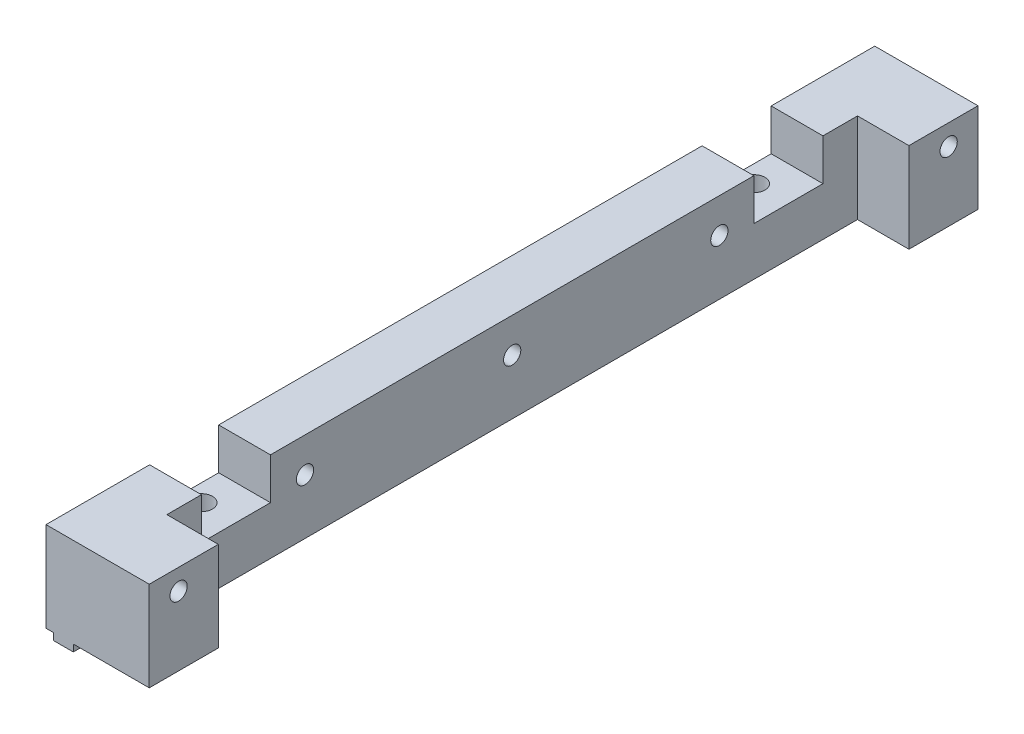
ISO-10303-21;
HEADER;
FILE_DESCRIPTION(('STEP AP214'),'2;1');
FILE_NAME('part.step','',(''),(''),'','','');
FILE_SCHEMA(('AUTOMOTIVE_DESIGN { 1 0 10303 214 1 1 1 1 }'));
ENDSEC;
DATA;
#1=APPLICATION_CONTEXT('core data for automotive mechanical design processes');
#2=APPLICATION_PROTOCOL_DEFINITION('international standard','automotive_design',2000,#1);
#3=PRODUCT_CONTEXT('',#1,'mechanical');
#4=PRODUCT('Part','Part','',(#3));
#5=PRODUCT_RELATED_PRODUCT_CATEGORY('part','',(#4));
#6=PRODUCT_DEFINITION_FORMATION('','',#4);
#7=PRODUCT_DEFINITION_CONTEXT('part definition',#1,'design');
#8=PRODUCT_DEFINITION('design','',#6,#7);
#9=PRODUCT_DEFINITION_SHAPE('','',#8);
#10=(LENGTH_UNIT() NAMED_UNIT(*) SI_UNIT(.MILLI.,.METRE.));
#11=(NAMED_UNIT(*) PLANE_ANGLE_UNIT() SI_UNIT($,.RADIAN.));
#12=(NAMED_UNIT(*) SI_UNIT($,.STERADIAN.) SOLID_ANGLE_UNIT());
#13=UNCERTAINTY_MEASURE_WITH_UNIT(LENGTH_MEASURE(1.E-05),#10,'distance_accuracy_value','');
#14=(GEOMETRIC_REPRESENTATION_CONTEXT(3) GLOBAL_UNCERTAINTY_ASSIGNED_CONTEXT((#13)) GLOBAL_UNIT_ASSIGNED_CONTEXT((#10,
#11,#12)) REPRESENTATION_CONTEXT('',''));
#15=CARTESIAN_POINT('',(0.,0.,0.));
#16=DIRECTION('',(0.,0.,1.));
#17=DIRECTION('',(1.,0.,0.));
#18=AXIS2_PLACEMENT_3D('',#15,#16,#17);
#19=CARTESIAN_POINT('',(0.,13.,60.));
#20=DIRECTION('',(0.,-1.,0.));
#21=DIRECTION('',(0.,0.,-1.));
#22=AXIS2_PLACEMENT_3D('',#19,#20,#21);
#23=PLANE('',#22);
#24=DIRECTION('',(0.,0.,-1.));
#25=VECTOR('',#24,1.);
#26=CARTESIAN_POINT('',(0.,13.,60.));
#27=LINE('',#26,#25);
#28=CARTESIAN_POINT('',(0.,13.,35.));
#29=VERTEX_POINT('',#28);
#30=CARTESIAN_POINT('',(0.,13.,-35.));
#31=VERTEX_POINT('',#30);
#32=EDGE_CURVE('E405',#29,#31,#27,.T.);
#33=ORIENTED_EDGE('',*,*,#32,.F.);
#34=DIRECTION('',(-1.,0.,0.));
#35=VECTOR('',#34,1.);
#36=CARTESIAN_POINT('',(14.95,13.,35.));
#37=LINE('',#36,#35);
#38=CARTESIAN_POINT('',(7.5,13.,35.));
#39=VERTEX_POINT('',#38);
#40=EDGE_CURVE('E232',#39,#29,#37,.T.);
#41=ORIENTED_EDGE('',*,*,#40,.F.);
#42=DIRECTION('',(0.,0.,1.));
#43=VECTOR('',#42,1.);
#44=CARTESIAN_POINT('',(7.5,13.,-50.));
#45=LINE('',#44,#43);
#46=CARTESIAN_POINT('',(7.5,13.,-35.));
#47=VERTEX_POINT('',#46);
#48=EDGE_CURVE('E287',#47,#39,#45,.T.);
#49=ORIENTED_EDGE('',*,*,#48,.F.);
#50=DIRECTION('',(-1.,0.,0.));
#51=VECTOR('',#50,1.);
#52=CARTESIAN_POINT('',(14.95,13.,-35.));
#53=LINE('',#52,#51);
#54=EDGE_CURVE('E256',#47,#31,#53,.T.);
#55=ORIENTED_EDGE('',*,*,#54,.T.);
#56=EDGE_LOOP('',(#33,#41,#49,#55));
#57=FACE_BOUND('',#56,.T.);
#58=ADVANCED_FACE('F33',(#57),#23,.F.);
#59=CARTESIAN_POINT('',(7.5,13.,45.));
#60=VERTEX_POINT('',#59);
#61=CARTESIAN_POINT('',(7.5,13.,50.));
#62=VERTEX_POINT('',#61);
#63=EDGE_CURVE('E281',#60,#62,#45,.T.);
#64=ORIENTED_EDGE('',*,*,#63,.F.);
#65=DIRECTION('',(-1.,0.,0.));
#66=VECTOR('',#65,1.);
#67=CARTESIAN_POINT('',(14.95,13.,45.));
#68=LINE('',#67,#66);
#69=CARTESIAN_POINT('',(0.,13.,45.));
#70=VERTEX_POINT('',#69);
#71=EDGE_CURVE('E242',#60,#70,#68,.T.);
#72=ORIENTED_EDGE('',*,*,#71,.T.);
#73=CARTESIAN_POINT('',(0.,13.,60.));
#74=VERTEX_POINT('',#73);
#75=EDGE_CURVE('E402',#74,#70,#27,.T.);
#76=ORIENTED_EDGE('',*,*,#75,.F.);
#77=DIRECTION('',(-1.,0.,0.));
#78=VECTOR('',#77,1.);
#79=CARTESIAN_POINT('',(0.,13.,60.));
#80=LINE('',#79,#78);
#81=CARTESIAN_POINT('',(14.95,13.,60.));
#82=VERTEX_POINT('',#81);
#83=EDGE_CURVE('E377',#82,#74,#80,.T.);
#84=ORIENTED_EDGE('',*,*,#83,.F.);
#85=DIRECTION('',(0.,0.,-1.));
#86=VECTOR('',#85,1.);
#87=CARTESIAN_POINT('',(14.95,13.,60.));
#88=LINE('',#87,#86);
#89=CARTESIAN_POINT('',(14.95,13.,50.));
#90=VERTEX_POINT('',#89);
#91=EDGE_CURVE('E406',#82,#90,#88,.T.);
#92=ORIENTED_EDGE('',*,*,#91,.T.);
#93=DIRECTION('',(1.,0.,0.));
#94=VECTOR('',#93,1.);
#95=CARTESIAN_POINT('',(7.5,13.,50.));
#96=LINE('',#95,#94);
#97=EDGE_CURVE('E303',#62,#90,#96,.T.);
#98=ORIENTED_EDGE('',*,*,#97,.F.);
#99=EDGE_LOOP('',(#64,#72,#76,#84,#92,#98));
#100=FACE_BOUND('',#99,.T.);
#101=ADVANCED_FACE('F487',(#100),#23,.F.);
#102=CARTESIAN_POINT('',(14.95,13.,60.));
#103=DIRECTION('',(-1.,0.,0.));
#104=DIRECTION('',(0.,-1.,0.));
#105=AXIS2_PLACEMENT_3D('',#102,#103,#104);
#106=PLANE('',#105);
#107=CARTESIAN_POINT('',(14.95,10.,-55.75));
#108=DIRECTION('',(1.,0.,0.));
#109=DIRECTION('',(0.,0.,-1.));
#110=AXIS2_PLACEMENT_3D('',#107,#108,#109);
#111=CIRCLE('',#110,1.25);
#112=CARTESIAN_POINT('',(14.95,10.,-57.));
#113=VERTEX_POINT('',#112);
#114=EDGE_CURVE('E352',#113,#113,#111,.T.);
#115=ORIENTED_EDGE('',*,*,#114,.F.);
#116=EDGE_LOOP('',(#115));
#117=FACE_BOUND('',#116,.T.);
#118=CARTESIAN_POINT('',(14.95,13.,-50.));
#119=VERTEX_POINT('',#118);
#120=CARTESIAN_POINT('',(14.95,13.,-60.));
#121=VERTEX_POINT('',#120);
#122=EDGE_CURVE('E404',#119,#121,#88,.T.);
#123=ORIENTED_EDGE('',*,*,#122,.F.);
#124=DIRECTION('',(0.,1.,0.));
#125=VECTOR('',#124,1.);
#126=CARTESIAN_POINT('',(14.95,0.,-50.));
#127=LINE('',#126,#125);
#128=CARTESIAN_POINT('',(14.95,0.,-50.));
#129=VERTEX_POINT('',#128);
#130=EDGE_CURVE('E294',#129,#119,#127,.T.);
#131=ORIENTED_EDGE('',*,*,#130,.F.);
#132=DIRECTION('',(0.,0.,-1.));
#133=VECTOR('',#132,1.);
#134=CARTESIAN_POINT('',(14.95,0.,60.));
#135=LINE('',#134,#133);
#136=CARTESIAN_POINT('',(14.95,0.,-60.));
#137=VERTEX_POINT('',#136);
#138=EDGE_CURVE('E409',#129,#137,#135,.T.);
#139=ORIENTED_EDGE('',*,*,#138,.T.);
#140=DIRECTION('',(0.,1.,0.));
#141=VECTOR('',#140,1.);
#142=CARTESIAN_POINT('',(14.95,13.,-60.));
#143=LINE('',#142,#141);
#144=EDGE_CURVE('E397',#137,#121,#143,.T.);
#145=ORIENTED_EDGE('',*,*,#144,.T.);
#146=EDGE_LOOP('',(#123,#131,#139,#145));
#147=FACE_BOUND('',#146,.T.);
#148=ADVANCED_FACE('F505',(#117,#147),#106,.F.);
#149=CARTESIAN_POINT('',(3.95,0.,60.));
#150=DIRECTION('',(-1.,0.,0.));
#151=DIRECTION('',(0.,0.,1.));
#152=AXIS2_PLACEMENT_3D('',#149,#150,#151);
#153=PLANE('',#152);
#154=DIRECTION('',(0.,0.,-1.));
#155=VECTOR('',#154,1.);
#156=CARTESIAN_POINT('',(3.95,0.,60.));
#157=LINE('',#156,#155);
#158=CARTESIAN_POINT('',(3.95,0.,-40.6763874629234));
#159=VERTEX_POINT('',#158);
#160=CARTESIAN_POINT('',(3.95,0.,-60.));
#161=VERTEX_POINT('',#160);
#162=EDGE_CURVE('E413',#159,#161,#157,.T.);
#163=ORIENTED_EDGE('',*,*,#162,.F.);
#164=DIRECTION('',(0.,-1.,0.));
#165=VECTOR('',#164,1.);
#166=CARTESIAN_POINT('',(3.95,13.,-40.6763874629234));
#167=LINE('',#166,#165);
#168=CARTESIAN_POINT('',(3.95,-1.,-40.6763874629234));
#169=VERTEX_POINT('',#168);
#170=EDGE_CURVE('E315',#159,#169,#167,.T.);
#171=ORIENTED_EDGE('',*,*,#170,.T.);
#172=DIRECTION('',(0.,0.,-1.));
#173=VECTOR('',#172,1.);
#174=CARTESIAN_POINT('',(3.95,-1.,60.));
#175=LINE('',#174,#173);
#176=CARTESIAN_POINT('',(3.95,-1.,-60.));
#177=VERTEX_POINT('',#176);
#178=EDGE_CURVE('E417',#169,#177,#175,.T.);
#179=ORIENTED_EDGE('',*,*,#178,.T.);
#180=DIRECTION('',(0.,1.,0.));
#181=VECTOR('',#180,1.);
#182=CARTESIAN_POINT('',(3.95,0.,-60.));
#183=LINE('',#182,#181);
#184=EDGE_CURVE('E391',#177,#161,#183,.T.);
#185=ORIENTED_EDGE('',*,*,#184,.T.);
#186=EDGE_LOOP('',(#163,#171,#179,#185));
#187=FACE_BOUND('',#186,.T.);
#188=ADVANCED_FACE('F515',(#187),#153,.F.);
#189=CARTESIAN_POINT('',(1.05,-1.,60.));
#190=DIRECTION('',(1.,0.,0.));
#191=DIRECTION('',(0.,0.,-1.));
#192=AXIS2_PLACEMENT_3D('',#189,#190,#191);
#193=PLANE('',#192);
#194=DIRECTION('',(0.,0.,-1.));
#195=VECTOR('',#194,1.);
#196=CARTESIAN_POINT('',(1.05,0.,60.));
#197=LINE('',#196,#195);
#198=CARTESIAN_POINT('',(1.05,0.,39.3236125370766));
#199=VERTEX_POINT('',#198);
#200=CARTESIAN_POINT('',(1.05,0.,-39.3236125370766));
#201=VERTEX_POINT('',#200);
#202=EDGE_CURVE('E433',#199,#201,#197,.T.);
#203=ORIENTED_EDGE('',*,*,#202,.T.);
#204=DIRECTION('',(0.,-1.,0.));
#205=VECTOR('',#204,1.);
#206=CARTESIAN_POINT('',(1.05,13.,-39.3236125370766));
#207=LINE('',#206,#205);
#208=CARTESIAN_POINT('',(1.05,-1.,-39.3236125370766));
#209=VERTEX_POINT('',#208);
#210=EDGE_CURVE('E324',#201,#209,#207,.T.);
#211=ORIENTED_EDGE('',*,*,#210,.T.);
#212=DIRECTION('',(0.,0.,-1.));
#213=VECTOR('',#212,1.);
#214=CARTESIAN_POINT('',(1.05,-1.,60.));
#215=LINE('',#214,#213);
#216=CARTESIAN_POINT('',(1.05,-1.,39.3236125370766));
#217=VERTEX_POINT('',#216);
#218=EDGE_CURVE('E428',#217,#209,#215,.T.);
#219=ORIENTED_EDGE('',*,*,#218,.F.);
#220=DIRECTION('',(0.,-1.,0.));
#221=VECTOR('',#220,1.);
#222=CARTESIAN_POINT('',(1.05,13.,39.3236125370766));
#223=LINE('',#222,#221);
#224=EDGE_CURVE('E339',#217,#199,#223,.F.);
#225=ORIENTED_EDGE('',*,*,#224,.T.);
#226=EDGE_LOOP('',(#203,#211,#219,#225));
#227=FACE_BOUND('',#226,.T.);
#228=ADVANCED_FACE('F701',(#227),#193,.F.);
#229=CARTESIAN_POINT('',(3.95,-1.,60.));
#230=DIRECTION('',(0.,1.,0.));
#231=DIRECTION('',(-1.,0.,0.));
#232=AXIS2_PLACEMENT_3D('',#229,#230,#231);
#233=PLANE('',#232);
#234=ORIENTED_EDGE('',*,*,#218,.T.);
#235=CARTESIAN_POINT('',(2.5,-1.,-40.));
#236=DIRECTION('',(0.,-1.,0.));
#237=DIRECTION('',(0.,0.,-1.));
#238=AXIS2_PLACEMENT_3D('',#235,#236,#237);
#239=CIRCLE('',#238,1.6);
#240=CARTESIAN_POINT('',(3.95,-1.,-39.3236125370766));
#241=VERTEX_POINT('',#240);
#242=EDGE_CURVE('E308',#241,#209,#239,.T.);
#243=ORIENTED_EDGE('',*,*,#242,.F.);
#244=CARTESIAN_POINT('',(3.95,-1.,39.3236125370766));
#245=VERTEX_POINT('',#244);
#246=EDGE_CURVE('E423',#245,#241,#175,.T.);
#247=ORIENTED_EDGE('',*,*,#246,.F.);
#248=CARTESIAN_POINT('',(2.5,-1.,40.));
#249=DIRECTION('',(0.,-1.,0.));
#250=DIRECTION('',(0.,0.,-1.));
#251=AXIS2_PLACEMENT_3D('',#248,#249,#250);
#252=CIRCLE('',#251,1.6);
#253=EDGE_CURVE('E327',#217,#245,#252,.T.);
#254=ORIENTED_EDGE('',*,*,#253,.F.);
#255=EDGE_LOOP('',(#234,#243,#247,#254));
#256=FACE_BOUND('',#255,.T.);
#257=ADVANCED_FACE('F709',(#256),#233,.F.);
#258=CARTESIAN_POINT('',(1.05,0.,60.));
#259=VERTEX_POINT('',#258);
#260=CARTESIAN_POINT('',(1.05,0.,40.6763874629234));
#261=VERTEX_POINT('',#260);
#262=EDGE_CURVE('E429',#259,#261,#197,.T.);
#263=ORIENTED_EDGE('',*,*,#262,.T.);
#264=DIRECTION('',(0.,-1.,0.));
#265=VECTOR('',#264,1.);
#266=CARTESIAN_POINT('',(1.05,13.,40.6763874629234));
#267=LINE('',#266,#265);
#268=CARTESIAN_POINT('',(1.05,-1.,40.6763874629234));
#269=VERTEX_POINT('',#268);
#270=EDGE_CURVE('E345',#261,#269,#267,.T.);
#271=ORIENTED_EDGE('',*,*,#270,.T.);
#272=CARTESIAN_POINT('',(1.05,-1.,60.));
#273=VERTEX_POINT('',#272);
#274=EDGE_CURVE('E424',#273,#269,#215,.T.);
#275=ORIENTED_EDGE('',*,*,#274,.F.);
#276=DIRECTION('',(0.,-1.,0.));
#277=VECTOR('',#276,1.);
#278=CARTESIAN_POINT('',(1.05,-1.,60.));
#279=LINE('',#278,#277);
#280=EDGE_CURVE('E367',#259,#273,#279,.T.);
#281=ORIENTED_EDGE('',*,*,#280,.F.);
#282=EDGE_LOOP('',(#263,#271,#275,#281));
#283=FACE_BOUND('',#282,.T.);
#284=ADVANCED_FACE('F712',(#283),#193,.F.);
#285=ORIENTED_EDGE('',*,*,#274,.T.);
#286=CARTESIAN_POINT('',(3.95,-1.,40.6763874629234));
#287=VERTEX_POINT('',#286);
#288=EDGE_CURVE('E329',#287,#269,#252,.T.);
#289=ORIENTED_EDGE('',*,*,#288,.F.);
#290=CARTESIAN_POINT('',(3.95,-1.,60.));
#291=VERTEX_POINT('',#290);
#292=EDGE_CURVE('E419',#291,#287,#175,.T.);
#293=ORIENTED_EDGE('',*,*,#292,.F.);
#294=DIRECTION('',(1.,0.,0.));
#295=VECTOR('',#294,1.);
#296=CARTESIAN_POINT('',(3.95,-1.,60.));
#297=LINE('',#296,#295);
#298=EDGE_CURVE('E369',#273,#291,#297,.T.);
#299=ORIENTED_EDGE('',*,*,#298,.F.);
#300=EDGE_LOOP('',(#285,#289,#293,#299));
#301=FACE_BOUND('',#300,.T.);
#302=ADVANCED_FACE('F721',(#301),#233,.F.);
#303=ORIENTED_EDGE('',*,*,#246,.T.);
#304=DIRECTION('',(0.,-1.,0.));
#305=VECTOR('',#304,1.);
#306=CARTESIAN_POINT('',(3.95,13.,-39.3236125370766));
#307=LINE('',#306,#305);
#308=CARTESIAN_POINT('',(3.95,0.,-39.3236125370766));
#309=VERTEX_POINT('',#308);
#310=EDGE_CURVE('E312',#241,#309,#307,.F.);
#311=ORIENTED_EDGE('',*,*,#310,.T.);
#312=CARTESIAN_POINT('',(3.95,0.,39.3236125370766));
#313=VERTEX_POINT('',#312);
#314=EDGE_CURVE('E418',#313,#309,#157,.T.);
#315=ORIENTED_EDGE('',*,*,#314,.F.);
#316=DIRECTION('',(0.,-1.,0.));
#317=VECTOR('',#316,1.);
#318=CARTESIAN_POINT('',(3.95,13.,39.3236125370766));
#319=LINE('',#318,#317);
#320=EDGE_CURVE('E336',#313,#245,#319,.T.);
#321=ORIENTED_EDGE('',*,*,#320,.T.);
#322=EDGE_LOOP('',(#303,#311,#315,#321));
#323=FACE_BOUND('',#322,.T.);
#324=ADVANCED_FACE('F663',(#323),#153,.F.);
#325=CARTESIAN_POINT('',(0.,0.,60.));
#326=DIRECTION('',(1.,0.,0.));
#327=DIRECTION('',(0.,0.,-1.));
#328=AXIS2_PLACEMENT_3D('',#325,#326,#327);
#329=PLANE('',#328);
#330=CARTESIAN_POINT('',(0.,8.00000000000001,-30.));
#331=DIRECTION('',(-1.,0.,0.));
#332=DIRECTION('',(0.,0.,1.));
#333=AXIS2_PLACEMENT_3D('',#330,#331,#332);
#334=CIRCLE('',#333,1.25);
#335=CARTESIAN_POINT('',(0.,8.00000000000001,-28.75));
#336=VERTEX_POINT('',#335);
#337=EDGE_CURVE('E268',#336,#336,#334,.T.);
#338=ORIENTED_EDGE('',*,*,#337,.F.);
#339=EDGE_LOOP('',(#338));
#340=FACE_BOUND('',#339,.T.);
#341=CARTESIAN_POINT('',(0.,8.00000000000001,30.));
#342=DIRECTION('',(-1.,0.,0.));
#343=DIRECTION('',(0.,0.,1.));
#344=AXIS2_PLACEMENT_3D('',#341,#342,#343);
#345=CIRCLE('',#344,1.25);
#346=CARTESIAN_POINT('',(0.,8.00000000000001,31.25));
#347=VERTEX_POINT('',#346);
#348=EDGE_CURVE('E267',#347,#347,#345,.T.);
#349=ORIENTED_EDGE('',*,*,#348,.F.);
#350=EDGE_LOOP('',(#349));
#351=FACE_BOUND('',#350,.T.);
#352=CARTESIAN_POINT('',(0.,8.00000000000001,0.));
#353=DIRECTION('',(-1.,0.,0.));
#354=DIRECTION('',(0.,0.,1.));
#355=AXIS2_PLACEMENT_3D('',#352,#353,#354);
#356=CIRCLE('',#355,1.25);
#357=CARTESIAN_POINT('',(0.,8.00000000000001,1.25));
#358=VERTEX_POINT('',#357);
#359=EDGE_CURVE('E274',#358,#358,#356,.T.);
#360=ORIENTED_EDGE('',*,*,#359,.F.);
#361=EDGE_LOOP('',(#360));
#362=FACE_BOUND('',#361,.T.);
#363=CARTESIAN_POINT('',(0.,10.,55.75));
#364=DIRECTION('',(1.,0.,0.));
#365=DIRECTION('',(0.,0.,-1.));
#366=AXIS2_PLACEMENT_3D('',#363,#364,#365);
#367=CIRCLE('',#366,1.25);
#368=CARTESIAN_POINT('',(0.,10.,54.5));
#369=VERTEX_POINT('',#368);
#370=EDGE_CURVE('E349',#369,#369,#367,.T.);
#371=ORIENTED_EDGE('',*,*,#370,.T.);
#372=EDGE_LOOP('',(#371));
#373=FACE_BOUND('',#372,.T.);
#374=CARTESIAN_POINT('',(0.,10.,-55.75));
#375=DIRECTION('',(1.,0.,0.));
#376=DIRECTION('',(0.,0.,-1.));
#377=AXIS2_PLACEMENT_3D('',#374,#375,#376);
#378=CIRCLE('',#377,1.25);
#379=CARTESIAN_POINT('',(0.,10.,-57.));
#380=VERTEX_POINT('',#379);
#381=EDGE_CURVE('E355',#380,#380,#378,.T.);
#382=ORIENTED_EDGE('',*,*,#381,.T.);
#383=EDGE_LOOP('',(#382));
#384=FACE_BOUND('',#383,.T.);
#385=DIRECTION('',(0.,0.,1.));
#386=VECTOR('',#385,1.);
#387=CARTESIAN_POINT('',(0.,7.00000000000001,35.));
#388=LINE('',#387,#386);
#389=CARTESIAN_POINT('',(0.,7.00000000000001,35.));
#390=VERTEX_POINT('',#389);
#391=CARTESIAN_POINT('',(0.,7.00000000000001,45.));
#392=VERTEX_POINT('',#391);
#393=EDGE_CURVE('E220',#390,#392,#388,.T.);
#394=ORIENTED_EDGE('',*,*,#393,.F.);
#395=DIRECTION('',(0.,-1.,0.));
#396=VECTOR('',#395,1.);
#397=CARTESIAN_POINT('',(0.,7.00000000000001,35.));
#398=LINE('',#397,#396);
#399=EDGE_CURVE('E229',#29,#390,#398,.T.);
#400=ORIENTED_EDGE('',*,*,#399,.F.);
#401=ORIENTED_EDGE('',*,*,#32,.T.);
#402=DIRECTION('',(0.,1.,0.));
#403=VECTOR('',#402,1.);
#404=CARTESIAN_POINT('',(0.,13.,-35.));
#405=LINE('',#404,#403);
#406=CARTESIAN_POINT('',(0.,7.,-35.));
#407=VERTEX_POINT('',#406);
#408=EDGE_CURVE('E248',#407,#31,#405,.T.);
#409=ORIENTED_EDGE('',*,*,#408,.F.);
#410=DIRECTION('',(0.,0.,1.));
#411=VECTOR('',#410,1.);
#412=CARTESIAN_POINT('',(0.,7.,-35.));
#413=LINE('',#412,#411);
#414=CARTESIAN_POINT('',(0.,7.,-45.));
#415=VERTEX_POINT('',#414);
#416=EDGE_CURVE('E253',#415,#407,#413,.T.);
#417=ORIENTED_EDGE('',*,*,#416,.F.);
#418=DIRECTION('',(0.,-1.,0.));
#419=VECTOR('',#418,1.);
#420=CARTESIAN_POINT('',(0.,13.,-45.));
#421=LINE('',#420,#419);
#422=CARTESIAN_POINT('',(0.,13.,-45.));
#423=VERTEX_POINT('',#422);
#424=EDGE_CURVE('E251',#423,#415,#421,.T.);
#425=ORIENTED_EDGE('',*,*,#424,.F.);
#426=CARTESIAN_POINT('',(0.,13.,-60.));
#427=VERTEX_POINT('',#426);
#428=EDGE_CURVE('E379',#423,#427,#27,.T.);
#429=ORIENTED_EDGE('',*,*,#428,.T.);
#430=DIRECTION('',(0.,-1.,0.));
#431=VECTOR('',#430,1.);
#432=CARTESIAN_POINT('',(0.,0.,-60.));
#433=LINE('',#432,#431);
#434=CARTESIAN_POINT('',(0.,0.,-60.));
#435=VERTEX_POINT('',#434);
#436=EDGE_CURVE('E358',#427,#435,#433,.T.);
#437=ORIENTED_EDGE('',*,*,#436,.T.);
#438=DIRECTION('',(0.,0.,-1.));
#439=VECTOR('',#438,1.);
#440=CARTESIAN_POINT('',(0.,0.,60.));
#441=LINE('',#440,#439);
#442=CARTESIAN_POINT('',(0.,0.,60.));
#443=VERTEX_POINT('',#442);
#444=EDGE_CURVE('E432',#443,#435,#441,.T.);
#445=ORIENTED_EDGE('',*,*,#444,.F.);
#446=DIRECTION('',(0.,-1.,0.));
#447=VECTOR('',#446,1.);
#448=CARTESIAN_POINT('',(0.,0.,60.));
#449=LINE('',#448,#447);
#450=EDGE_CURVE('E361',#74,#443,#449,.T.);
#451=ORIENTED_EDGE('',*,*,#450,.F.);
#452=ORIENTED_EDGE('',*,*,#75,.T.);
#453=DIRECTION('',(0.,1.,0.));
#454=VECTOR('',#453,1.);
#455=CARTESIAN_POINT('',(0.,7.00000000000001,45.));
#456=LINE('',#455,#454);
#457=EDGE_CURVE('E226',#392,#70,#456,.T.);
#458=ORIENTED_EDGE('',*,*,#457,.F.);
#459=EDGE_LOOP('',(#394,#400,#401,#409,#417,#425,#429,#437,#445,#451,#452,#458));
#460=FACE_BOUND('',#459,.T.);
#461=ADVANCED_FACE('F35',(#340,#351,#362,#373,#384,#460),#329,.F.);
#462=CARTESIAN_POINT('',(1.05,0.,60.));
#463=DIRECTION('',(0.,1.,0.));
#464=DIRECTION('',(-1.,0.,0.));
#465=AXIS2_PLACEMENT_3D('',#462,#463,#464);
#466=PLANE('',#465);
#467=CARTESIAN_POINT('',(1.05,0.,-40.6763874629234));
#468=VERTEX_POINT('',#467);
#469=CARTESIAN_POINT('',(1.05,0.,-60.));
#470=VERTEX_POINT('',#469);
#471=EDGE_CURVE('E427',#468,#470,#197,.T.);
#472=ORIENTED_EDGE('',*,*,#471,.F.);
#473=CARTESIAN_POINT('',(2.5,0.,-40.));
#474=DIRECTION('',(0.,1.,0.));
#475=DIRECTION('',(-1.,0.,0.));
#476=AXIS2_PLACEMENT_3D('',#473,#474,#475);
#477=CIRCLE('',#476,1.6);
#478=EDGE_CURVE('E321',#468,#201,#477,.T.);
#479=ORIENTED_EDGE('',*,*,#478,.T.);
#480=ORIENTED_EDGE('',*,*,#202,.F.);
#481=CARTESIAN_POINT('',(2.5,0.,40.));
#482=DIRECTION('',(0.,1.,0.));
#483=DIRECTION('',(-1.,0.,0.));
#484=AXIS2_PLACEMENT_3D('',#481,#482,#483);
#485=CIRCLE('',#484,1.6);
#486=EDGE_CURVE('E342',#199,#261,#485,.T.);
#487=ORIENTED_EDGE('',*,*,#486,.T.);
#488=ORIENTED_EDGE('',*,*,#262,.F.);
#489=DIRECTION('',(1.,0.,0.));
#490=VECTOR('',#489,1.);
#491=CARTESIAN_POINT('',(1.05,0.,60.));
#492=LINE('',#491,#490);
#493=EDGE_CURVE('E364',#443,#259,#492,.T.);
#494=ORIENTED_EDGE('',*,*,#493,.F.);
#495=ORIENTED_EDGE('',*,*,#444,.T.);
#496=DIRECTION('',(1.,0.,0.));
#497=VECTOR('',#496,1.);
#498=CARTESIAN_POINT('',(1.05,0.,-60.));
#499=LINE('',#498,#497);
#500=EDGE_CURVE('E382',#435,#470,#499,.T.);
#501=ORIENTED_EDGE('',*,*,#500,.T.);
#502=EDGE_LOOP('',(#472,#479,#480,#487,#488,#494,#495,#501));
#503=FACE_BOUND('',#502,.T.);
#504=ADVANCED_FACE('F477',(#503),#466,.F.);
#505=CARTESIAN_POINT('',(1.05,-1.,-40.6763874629234));
#506=VERTEX_POINT('',#505);
#507=CARTESIAN_POINT('',(1.05,-1.,-60.));
#508=VERTEX_POINT('',#507);
#509=EDGE_CURVE('E422',#506,#508,#215,.T.);
#510=ORIENTED_EDGE('',*,*,#509,.F.);
#511=DIRECTION('',(0.,-1.,0.));
#512=VECTOR('',#511,1.);
#513=CARTESIAN_POINT('',(1.05,13.,-40.6763874629234));
#514=LINE('',#513,#512);
#515=EDGE_CURVE('E318',#506,#468,#514,.F.);
#516=ORIENTED_EDGE('',*,*,#515,.T.);
#517=ORIENTED_EDGE('',*,*,#471,.T.);
#518=DIRECTION('',(0.,-1.,0.));
#519=VECTOR('',#518,1.);
#520=CARTESIAN_POINT('',(1.05,-1.,-60.));
#521=LINE('',#520,#519);
#522=EDGE_CURVE('E385',#470,#508,#521,.T.);
#523=ORIENTED_EDGE('',*,*,#522,.T.);
#524=EDGE_LOOP('',(#510,#516,#517,#523));
#525=FACE_BOUND('',#524,.T.);
#526=ADVANCED_FACE('F713',(#525),#193,.F.);
#527=ORIENTED_EDGE('',*,*,#178,.F.);
#528=EDGE_CURVE('E299',#506,#169,#239,.T.);
#529=ORIENTED_EDGE('',*,*,#528,.F.);
#530=ORIENTED_EDGE('',*,*,#509,.T.);
#531=DIRECTION('',(1.,0.,0.));
#532=VECTOR('',#531,1.);
#533=CARTESIAN_POINT('',(3.95,-1.,-60.));
#534=LINE('',#533,#532);
#535=EDGE_CURVE('E388',#508,#177,#534,.T.);
#536=ORIENTED_EDGE('',*,*,#535,.T.);
#537=EDGE_LOOP('',(#527,#529,#530,#536));
#538=FACE_BOUND('',#537,.T.);
#539=ADVANCED_FACE('F722',(#538),#233,.F.);
#540=ORIENTED_EDGE('',*,*,#292,.T.);
#541=DIRECTION('',(0.,-1.,0.));
#542=VECTOR('',#541,1.);
#543=CARTESIAN_POINT('',(3.95,13.,40.6763874629234));
#544=LINE('',#543,#542);
#545=CARTESIAN_POINT('',(3.95,0.,40.6763874629234));
#546=VERTEX_POINT('',#545);
#547=EDGE_CURVE('E333',#287,#546,#544,.F.);
#548=ORIENTED_EDGE('',*,*,#547,.T.);
#549=CARTESIAN_POINT('',(3.95,0.,60.));
#550=VERTEX_POINT('',#549);
#551=EDGE_CURVE('E414',#550,#546,#157,.T.);
#552=ORIENTED_EDGE('',*,*,#551,.F.);
#553=DIRECTION('',(0.,1.,0.));
#554=VECTOR('',#553,1.);
#555=CARTESIAN_POINT('',(3.95,0.,60.));
#556=LINE('',#555,#554);
#557=EDGE_CURVE('E371',#291,#550,#556,.T.);
#558=ORIENTED_EDGE('',*,*,#557,.F.);
#559=EDGE_LOOP('',(#540,#548,#552,#558));
#560=FACE_BOUND('',#559,.T.);
#561=ADVANCED_FACE('F511',(#560),#153,.F.);
#562=CARTESIAN_POINT('',(14.95,0.,60.));
#563=DIRECTION('',(0.,1.,0.));
#564=DIRECTION('',(-1.,0.,0.));
#565=AXIS2_PLACEMENT_3D('',#562,#563,#564);
#566=PLANE('',#565);
#567=ORIENTED_EDGE('',*,*,#138,.F.);
#568=DIRECTION('',(1.,0.,0.));
#569=VECTOR('',#568,1.);
#570=CARTESIAN_POINT('',(7.5,0.,-50.));
#571=LINE('',#570,#569);
#572=CARTESIAN_POINT('',(7.5,0.,-50.));
#573=VERTEX_POINT('',#572);
#574=EDGE_CURVE('E297',#573,#129,#571,.T.);
#575=ORIENTED_EDGE('',*,*,#574,.F.);
#576=DIRECTION('',(0.,0.,-1.));
#577=VECTOR('',#576,1.);
#578=CARTESIAN_POINT('',(7.5,0.,-50.));
#579=LINE('',#578,#577);
#580=CARTESIAN_POINT('',(7.5,0.,50.));
#581=VERTEX_POINT('',#580);
#582=EDGE_CURVE('E290',#581,#573,#579,.T.);
#583=ORIENTED_EDGE('',*,*,#582,.F.);
#584=DIRECTION('',(1.,0.,0.));
#585=VECTOR('',#584,1.);
#586=CARTESIAN_POINT('',(7.5,0.,50.));
#587=LINE('',#586,#585);
#588=CARTESIAN_POINT('',(14.95,0.,50.));
#589=VERTEX_POINT('',#588);
#590=EDGE_CURVE('E300',#581,#589,#587,.T.);
#591=ORIENTED_EDGE('',*,*,#590,.T.);
#592=CARTESIAN_POINT('',(14.95,0.,60.));
#593=VERTEX_POINT('',#592);
#594=EDGE_CURVE('E410',#593,#589,#135,.T.);
#595=ORIENTED_EDGE('',*,*,#594,.F.);
#596=DIRECTION('',(1.,0.,0.));
#597=VECTOR('',#596,1.);
#598=CARTESIAN_POINT('',(14.95,0.,60.));
#599=LINE('',#598,#597);
#600=EDGE_CURVE('E373',#550,#593,#599,.T.);
#601=ORIENTED_EDGE('',*,*,#600,.F.);
#602=ORIENTED_EDGE('',*,*,#551,.T.);
#603=CARTESIAN_POINT('',(2.5,0.,40.));
#604=DIRECTION('',(0.,1.,0.));
#605=DIRECTION('',(-1.,0.,0.));
#606=AXIS2_PLACEMENT_3D('',#603,#604,#605);
#607=CIRCLE('',#606,1.6);
#608=EDGE_CURVE('E330',#546,#313,#607,.T.);
#609=ORIENTED_EDGE('',*,*,#608,.T.);
#610=ORIENTED_EDGE('',*,*,#314,.T.);
#611=CARTESIAN_POINT('',(2.5,0.,-40.));
#612=DIRECTION('',(0.,1.,0.));
#613=DIRECTION('',(-1.,0.,0.));
#614=AXIS2_PLACEMENT_3D('',#611,#612,#613);
#615=CIRCLE('',#614,1.6);
#616=EDGE_CURVE('E309',#309,#159,#615,.T.);
#617=ORIENTED_EDGE('',*,*,#616,.T.);
#618=ORIENTED_EDGE('',*,*,#162,.T.);
#619=DIRECTION('',(1.,0.,0.));
#620=VECTOR('',#619,1.);
#621=CARTESIAN_POINT('',(14.95,0.,-60.));
#622=LINE('',#621,#620);
#623=EDGE_CURVE('E394',#161,#137,#622,.T.);
#624=ORIENTED_EDGE('',*,*,#623,.T.);
#625=EDGE_LOOP('',(#567,#575,#583,#591,#595,#601,#602,#609,#610,#617,#618,#624));
#626=FACE_BOUND('',#625,.T.);
#627=ADVANCED_FACE('F497',(#626),#566,.F.);
#628=CARTESIAN_POINT('',(14.95,10.,55.75));
#629=DIRECTION('',(1.,0.,0.));
#630=DIRECTION('',(0.,0.,-1.));
#631=AXIS2_PLACEMENT_3D('',#628,#629,#630);
#632=CIRCLE('',#631,1.25);
#633=CARTESIAN_POINT('',(14.95,10.,54.5));
#634=VERTEX_POINT('',#633);
#635=EDGE_CURVE('E348',#634,#634,#632,.T.);
#636=ORIENTED_EDGE('',*,*,#635,.F.);
#637=EDGE_LOOP('',(#636));
#638=FACE_BOUND('',#637,.T.);
#639=ORIENTED_EDGE('',*,*,#594,.T.);
#640=DIRECTION('',(0.,-1.,0.));
#641=VECTOR('',#640,1.);
#642=CARTESIAN_POINT('',(14.95,0.,50.));
#643=LINE('',#642,#641);
#644=EDGE_CURVE('E282',#90,#589,#643,.T.);
#645=ORIENTED_EDGE('',*,*,#644,.F.);
#646=ORIENTED_EDGE('',*,*,#91,.F.);
#647=DIRECTION('',(0.,1.,0.));
#648=VECTOR('',#647,1.);
#649=CARTESIAN_POINT('',(14.95,13.,60.));
#650=LINE('',#649,#648);
#651=EDGE_CURVE('E375',#593,#82,#650,.T.);
#652=ORIENTED_EDGE('',*,*,#651,.F.);
#653=EDGE_LOOP('',(#639,#645,#646,#652));
#654=FACE_BOUND('',#653,.T.);
#655=ADVANCED_FACE('F501',(#638,#654),#106,.F.);
#656=ORIENTED_EDGE('',*,*,#428,.F.);
#657=DIRECTION('',(-1.,0.,0.));
#658=VECTOR('',#657,1.);
#659=CARTESIAN_POINT('',(14.95,13.,-45.));
#660=LINE('',#659,#658);
#661=CARTESIAN_POINT('',(7.5,13.,-45.));
#662=VERTEX_POINT('',#661);
#663=EDGE_CURVE('E261',#662,#423,#660,.T.);
#664=ORIENTED_EDGE('',*,*,#663,.F.);
#665=CARTESIAN_POINT('',(7.5,13.,-50.));
#666=VERTEX_POINT('',#665);
#667=EDGE_CURVE('E283',#666,#662,#45,.T.);
#668=ORIENTED_EDGE('',*,*,#667,.F.);
#669=DIRECTION('',(1.,0.,0.));
#670=VECTOR('',#669,1.);
#671=CARTESIAN_POINT('',(7.5,13.,-50.));
#672=LINE('',#671,#670);
#673=EDGE_CURVE('E293',#666,#119,#672,.T.);
#674=ORIENTED_EDGE('',*,*,#673,.T.);
#675=ORIENTED_EDGE('',*,*,#122,.T.);
#676=DIRECTION('',(-1.,0.,0.));
#677=VECTOR('',#676,1.);
#678=CARTESIAN_POINT('',(0.,13.,-60.));
#679=LINE('',#678,#677);
#680=EDGE_CURVE('E365',#121,#427,#679,.T.);
#681=ORIENTED_EDGE('',*,*,#680,.T.);
#682=EDGE_LOOP('',(#656,#664,#668,#674,#675,#681));
#683=FACE_BOUND('',#682,.T.);
#684=ADVANCED_FACE('F468',(#683),#23,.F.);
#685=CARTESIAN_POINT('',(0.,0.,60.));
#686=DIRECTION('',(0.,0.,-1.));
#687=DIRECTION('',(-1.,0.,0.));
#688=AXIS2_PLACEMENT_3D('',#685,#686,#687);
#689=PLANE('',#688);
#690=ORIENTED_EDGE('',*,*,#450,.T.);
#691=ORIENTED_EDGE('',*,*,#493,.T.);
#692=ORIENTED_EDGE('',*,*,#280,.T.);
#693=ORIENTED_EDGE('',*,*,#298,.T.);
#694=ORIENTED_EDGE('',*,*,#557,.T.);
#695=ORIENTED_EDGE('',*,*,#600,.T.);
#696=ORIENTED_EDGE('',*,*,#651,.T.);
#697=ORIENTED_EDGE('',*,*,#83,.T.);
#698=EDGE_LOOP('',(#690,#691,#692,#693,#694,#695,#696,#697));
#699=FACE_BOUND('',#698,.T.);
#700=ADVANCED_FACE('F482',(#699),#689,.F.);
#701=CARTESIAN_POINT('',(0.,0.,-60.));
#702=DIRECTION('',(0.,0.,-1.));
#703=DIRECTION('',(-1.,0.,0.));
#704=AXIS2_PLACEMENT_3D('',#701,#702,#703);
#705=PLANE('',#704);
#706=ORIENTED_EDGE('',*,*,#436,.F.);
#707=ORIENTED_EDGE('',*,*,#680,.F.);
#708=ORIENTED_EDGE('',*,*,#144,.F.);
#709=ORIENTED_EDGE('',*,*,#623,.F.);
#710=ORIENTED_EDGE('',*,*,#184,.F.);
#711=ORIENTED_EDGE('',*,*,#535,.F.);
#712=ORIENTED_EDGE('',*,*,#522,.F.);
#713=ORIENTED_EDGE('',*,*,#500,.F.);
#714=EDGE_LOOP('',(#706,#707,#708,#709,#710,#711,#712,#713));
#715=FACE_BOUND('',#714,.T.);
#716=ADVANCED_FACE('F472',(#715),#705,.T.);
#717=CARTESIAN_POINT('',(0.,10.,-55.75));
#718=DIRECTION('',(1.,0.,0.));
#719=DIRECTION('',(0.,0.,-1.));
#720=AXIS2_PLACEMENT_3D('',#717,#718,#719);
#721=CYLINDRICAL_SURFACE('',#720,1.25);
#722=ORIENTED_EDGE('',*,*,#381,.F.);
#723=EDGE_LOOP('',(#722));
#724=FACE_BOUND('',#723,.T.);
#725=ORIENTED_EDGE('',*,*,#114,.T.);
#726=EDGE_LOOP('',(#725));
#727=FACE_BOUND('',#726,.T.);
#728=ADVANCED_FACE('F524',(#724,#727),#721,.F.);
#729=CARTESIAN_POINT('',(0.,10.,55.75));
#730=DIRECTION('',(1.,0.,0.));
#731=DIRECTION('',(0.,0.,-1.));
#732=AXIS2_PLACEMENT_3D('',#729,#730,#731);
#733=CYLINDRICAL_SURFACE('',#732,1.25);
#734=ORIENTED_EDGE('',*,*,#370,.F.);
#735=EDGE_LOOP('',(#734));
#736=FACE_BOUND('',#735,.T.);
#737=ORIENTED_EDGE('',*,*,#635,.T.);
#738=EDGE_LOOP('',(#737));
#739=FACE_BOUND('',#738,.T.);
#740=ADVANCED_FACE('F529',(#736,#739),#733,.F.);
#741=CARTESIAN_POINT('',(2.5,13.,40.));
#742=DIRECTION('',(0.,-1.,0.));
#743=DIRECTION('',(0.,0.,-1.));
#744=AXIS2_PLACEMENT_3D('',#741,#742,#743);
#745=CYLINDRICAL_SURFACE('',#744,1.6);
#746=CARTESIAN_POINT('',(2.5,7.00000000000001,40.));
#747=DIRECTION('',(0.,-1.,0.));
#748=DIRECTION('',(0.,0.,-1.));
#749=AXIS2_PLACEMENT_3D('',#746,#747,#748);
#750=CIRCLE('',#749,1.6);
#751=CARTESIAN_POINT('',(2.5,7.00000000000001,38.4));
#752=VERTEX_POINT('',#751);
#753=EDGE_CURVE('E241',#752,#752,#750,.F.);
#754=ORIENTED_EDGE('',*,*,#753,.T.);
#755=EDGE_LOOP('',(#754));
#756=FACE_BOUND('',#755,.T.);
#757=ORIENTED_EDGE('',*,*,#486,.F.);
#758=ORIENTED_EDGE('',*,*,#224,.F.);
#759=ORIENTED_EDGE('',*,*,#253,.T.);
#760=ORIENTED_EDGE('',*,*,#320,.F.);
#761=ORIENTED_EDGE('',*,*,#608,.F.);
#762=ORIENTED_EDGE('',*,*,#547,.F.);
#763=ORIENTED_EDGE('',*,*,#288,.T.);
#764=ORIENTED_EDGE('',*,*,#270,.F.);
#765=EDGE_LOOP('',(#757,#758,#759,#760,#761,#762,#763,#764));
#766=FACE_BOUND('',#765,.T.);
#767=ADVANCED_FACE('F533',(#756,#766),#745,.F.);
#768=CARTESIAN_POINT('',(2.5,13.,-40.));
#769=DIRECTION('',(0.,-1.,0.));
#770=DIRECTION('',(0.,0.,-1.));
#771=AXIS2_PLACEMENT_3D('',#768,#769,#770);
#772=CYLINDRICAL_SURFACE('',#771,1.6);
#773=CARTESIAN_POINT('',(2.5,7.,-40.));
#774=DIRECTION('',(0.,-1.,0.));
#775=DIRECTION('',(0.,0.,-1.));
#776=AXIS2_PLACEMENT_3D('',#773,#774,#775);
#777=CIRCLE('',#776,1.6);
#778=CARTESIAN_POINT('',(2.5,7.,-41.6));
#779=VERTEX_POINT('',#778);
#780=EDGE_CURVE('E259',#779,#779,#777,.F.);
#781=ORIENTED_EDGE('',*,*,#780,.T.);
#782=EDGE_LOOP('',(#781));
#783=FACE_BOUND('',#782,.T.);
#784=ORIENTED_EDGE('',*,*,#478,.F.);
#785=ORIENTED_EDGE('',*,*,#515,.F.);
#786=ORIENTED_EDGE('',*,*,#528,.T.);
#787=ORIENTED_EDGE('',*,*,#170,.F.);
#788=ORIENTED_EDGE('',*,*,#616,.F.);
#789=ORIENTED_EDGE('',*,*,#310,.F.);
#790=ORIENTED_EDGE('',*,*,#242,.T.);
#791=ORIENTED_EDGE('',*,*,#210,.F.);
#792=EDGE_LOOP('',(#784,#785,#786,#787,#788,#789,#790,#791));
#793=FACE_BOUND('',#792,.T.);
#794=ADVANCED_FACE('F537',(#783,#793),#772,.F.);
#795=CARTESIAN_POINT('',(7.5,0.,-50.));
#796=DIRECTION('',(0.,0.,-1.));
#797=DIRECTION('',(0.,1.,0.));
#798=AXIS2_PLACEMENT_3D('',#795,#796,#797);
#799=PLANE('',#798);
#800=ORIENTED_EDGE('',*,*,#130,.T.);
#801=ORIENTED_EDGE('',*,*,#673,.F.);
#802=DIRECTION('',(0.,1.,0.));
#803=VECTOR('',#802,1.);
#804=CARTESIAN_POINT('',(7.5,0.,-50.));
#805=LINE('',#804,#803);
#806=EDGE_CURVE('E279',#573,#666,#805,.T.);
#807=ORIENTED_EDGE('',*,*,#806,.F.);
#808=ORIENTED_EDGE('',*,*,#574,.T.);
#809=EDGE_LOOP('',(#800,#801,#807,#808));
#810=FACE_BOUND('',#809,.T.);
#811=ADVANCED_FACE('F541',(#810),#799,.F.);
#812=CARTESIAN_POINT('',(7.5,0.,50.));
#813=DIRECTION('',(0.,0.,1.));
#814=DIRECTION('',(1.,0.,0.));
#815=AXIS2_PLACEMENT_3D('',#812,#813,#814);
#816=PLANE('',#815);
#817=ORIENTED_EDGE('',*,*,#644,.T.);
#818=ORIENTED_EDGE('',*,*,#590,.F.);
#819=DIRECTION('',(0.,-1.,0.));
#820=VECTOR('',#819,1.);
#821=CARTESIAN_POINT('',(7.5,0.,50.));
#822=LINE('',#821,#820);
#823=EDGE_CURVE('E286',#62,#581,#822,.T.);
#824=ORIENTED_EDGE('',*,*,#823,.F.);
#825=ORIENTED_EDGE('',*,*,#97,.T.);
#826=EDGE_LOOP('',(#817,#818,#824,#825));
#827=FACE_BOUND('',#826,.T.);
#828=ADVANCED_FACE('F492',(#827),#816,.F.);
#829=CARTESIAN_POINT('',(7.5,0.,0.));
#830=DIRECTION('',(1.,0.,0.));
#831=DIRECTION('',(0.,1.,0.));
#832=AXIS2_PLACEMENT_3D('',#829,#830,#831);
#833=PLANE('',#832);
#834=DIRECTION('',(0.,1.,0.));
#835=VECTOR('',#834,1.);
#836=CARTESIAN_POINT('',(7.5,0.,35.));
#837=LINE('',#836,#835);
#838=CARTESIAN_POINT('',(7.5,7.00000000000001,35.));
#839=VERTEX_POINT('',#838);
#840=EDGE_CURVE('E11',#839,#39,#837,.T.);
#841=ORIENTED_EDGE('',*,*,#840,.F.);
#842=DIRECTION('',(0.,0.,-1.));
#843=VECTOR('',#842,1.);
#844=CARTESIAN_POINT('',(7.5,7.00000000000001,0.));
#845=LINE('',#844,#843);
#846=CARTESIAN_POINT('',(7.5,7.00000000000001,45.));
#847=VERTEX_POINT('',#846);
#848=EDGE_CURVE('E223',#847,#839,#845,.T.);
#849=ORIENTED_EDGE('',*,*,#848,.F.);
#850=DIRECTION('',(0.,-1.,0.));
#851=VECTOR('',#850,1.);
#852=CARTESIAN_POINT('',(7.5,0.,45.));
#853=LINE('',#852,#851);
#854=EDGE_CURVE('E41',#60,#847,#853,.T.);
#855=ORIENTED_EDGE('',*,*,#854,.F.);
#856=ORIENTED_EDGE('',*,*,#63,.T.);
#857=ORIENTED_EDGE('',*,*,#823,.T.);
#858=ORIENTED_EDGE('',*,*,#582,.T.);
#859=ORIENTED_EDGE('',*,*,#806,.T.);
#860=ORIENTED_EDGE('',*,*,#667,.T.);
#861=DIRECTION('',(0.,1.,0.));
#862=VECTOR('',#861,1.);
#863=CARTESIAN_POINT('',(7.5,0.,-45.));
#864=LINE('',#863,#862);
#865=CARTESIAN_POINT('',(7.5,7.,-45.));
#866=VERTEX_POINT('',#865);
#867=EDGE_CURVE('E436',#866,#662,#864,.T.);
#868=ORIENTED_EDGE('',*,*,#867,.F.);
#869=DIRECTION('',(0.,0.,-1.));
#870=VECTOR('',#869,1.);
#871=CARTESIAN_POINT('',(7.5,7.00000000000001,0.));
#872=LINE('',#871,#870);
#873=CARTESIAN_POINT('',(7.5,7.,-35.));
#874=VERTEX_POINT('',#873);
#875=EDGE_CURVE('E444',#874,#866,#872,.T.);
#876=ORIENTED_EDGE('',*,*,#875,.F.);
#877=DIRECTION('',(0.,-1.,0.));
#878=VECTOR('',#877,1.);
#879=CARTESIAN_POINT('',(7.5,0.,-35.));
#880=LINE('',#879,#878);
#881=EDGE_CURVE('E446',#47,#874,#880,.T.);
#882=ORIENTED_EDGE('',*,*,#881,.F.);
#883=ORIENTED_EDGE('',*,*,#48,.T.);
#884=EDGE_LOOP('',(#841,#849,#855,#856,#857,#858,#859,#860,#868,#876,#882,#883));
#885=FACE_BOUND('',#884,.T.);
#886=CARTESIAN_POINT('',(7.5,8.00000000000001,-30.));
#887=DIRECTION('',(1.,0.,0.));
#888=DIRECTION('',(0.,1.,0.));
#889=AXIS2_PLACEMENT_3D('',#886,#887,#888);
#890=CIRCLE('',#889,1.25);
#891=CARTESIAN_POINT('',(7.5,9.25000000000001,-30.));
#892=VERTEX_POINT('',#891);
#893=EDGE_CURVE('E278',#892,#892,#890,.T.);
#894=ORIENTED_EDGE('',*,*,#893,.F.);
#895=EDGE_LOOP('',(#894));
#896=FACE_BOUND('',#895,.T.);
#897=CARTESIAN_POINT('',(7.5,8.00000000000001,30.));
#898=DIRECTION('',(1.,0.,0.));
#899=DIRECTION('',(0.,1.,0.));
#900=AXIS2_PLACEMENT_3D('',#897,#898,#899);
#901=CIRCLE('',#900,1.25);
#902=CARTESIAN_POINT('',(7.5,9.25000000000001,30.));
#903=VERTEX_POINT('',#902);
#904=EDGE_CURVE('E271',#903,#903,#901,.T.);
#905=ORIENTED_EDGE('',*,*,#904,.F.);
#906=EDGE_LOOP('',(#905));
#907=FACE_BOUND('',#906,.T.);
#908=CARTESIAN_POINT('',(7.5,8.00000000000001,0.));
#909=DIRECTION('',(1.,0.,0.));
#910=DIRECTION('',(0.,1.,0.));
#911=AXIS2_PLACEMENT_3D('',#908,#909,#910);
#912=CIRCLE('',#911,1.25);
#913=CARTESIAN_POINT('',(7.5,9.25000000000001,0.));
#914=VERTEX_POINT('',#913);
#915=EDGE_CURVE('E277',#914,#914,#912,.T.);
#916=ORIENTED_EDGE('',*,*,#915,.F.);
#917=EDGE_LOOP('',(#916));
#918=FACE_BOUND('',#917,.T.);
#919=ADVANCED_FACE('F453',(#885,#896,#907,#918),#833,.T.);
#920=CARTESIAN_POINT('',(14.95,8.00000000000001,0.));
#921=DIRECTION('',(-1.,0.,0.));
#922=DIRECTION('',(0.,0.,1.));
#923=AXIS2_PLACEMENT_3D('',#920,#921,#922);
#924=CYLINDRICAL_SURFACE('',#923,1.25);
#925=ORIENTED_EDGE('',*,*,#915,.T.);
#926=EDGE_LOOP('',(#925));
#927=FACE_BOUND('',#926,.T.);
#928=ORIENTED_EDGE('',*,*,#359,.T.);
#929=EDGE_LOOP('',(#928));
#930=FACE_BOUND('',#929,.T.);
#931=ADVANCED_FACE('F550',(#927,#930),#924,.F.);
#932=CARTESIAN_POINT('',(14.95,8.00000000000001,30.));
#933=DIRECTION('',(-1.,0.,0.));
#934=DIRECTION('',(0.,0.,1.));
#935=AXIS2_PLACEMENT_3D('',#932,#933,#934);
#936=CYLINDRICAL_SURFACE('',#935,1.25);
#937=ORIENTED_EDGE('',*,*,#904,.T.);
#938=EDGE_LOOP('',(#937));
#939=FACE_BOUND('',#938,.T.);
#940=ORIENTED_EDGE('',*,*,#348,.T.);
#941=EDGE_LOOP('',(#940));
#942=FACE_BOUND('',#941,.T.);
#943=ADVANCED_FACE('F553',(#939,#942),#936,.F.);
#944=CARTESIAN_POINT('',(14.95,8.00000000000001,-30.));
#945=DIRECTION('',(-1.,0.,0.));
#946=DIRECTION('',(0.,0.,1.));
#947=AXIS2_PLACEMENT_3D('',#944,#945,#946);
#948=CYLINDRICAL_SURFACE('',#947,1.25);
#949=ORIENTED_EDGE('',*,*,#893,.T.);
#950=EDGE_LOOP('',(#949));
#951=FACE_BOUND('',#950,.T.);
#952=ORIENTED_EDGE('',*,*,#337,.T.);
#953=EDGE_LOOP('',(#952));
#954=FACE_BOUND('',#953,.T.);
#955=ADVANCED_FACE('F557',(#951,#954),#948,.F.);
#956=CARTESIAN_POINT('',(14.95,7.,-35.));
#957=DIRECTION('',(0.,-1.,0.));
#958=DIRECTION('',(0.,0.,-1.));
#959=AXIS2_PLACEMENT_3D('',#956,#957,#958);
#960=PLANE('',#959);
#961=ORIENTED_EDGE('',*,*,#875,.T.);
#962=DIRECTION('',(-1.,0.,0.));
#963=VECTOR('',#962,1.);
#964=CARTESIAN_POINT('',(14.95,7.,-45.));
#965=LINE('',#964,#963);
#966=EDGE_CURVE('E56',#866,#415,#965,.T.);
#967=ORIENTED_EDGE('',*,*,#966,.T.);
#968=ORIENTED_EDGE('',*,*,#416,.T.);
#969=DIRECTION('',(-1.,0.,0.));
#970=VECTOR('',#969,1.);
#971=CARTESIAN_POINT('',(14.95,7.,-35.));
#972=LINE('',#971,#970);
#973=EDGE_CURVE('E257',#874,#407,#972,.T.);
#974=ORIENTED_EDGE('',*,*,#973,.F.);
#975=EDGE_LOOP('',(#961,#967,#968,#974));
#976=FACE_BOUND('',#975,.T.);
#977=ORIENTED_EDGE('',*,*,#780,.F.);
#978=EDGE_LOOP('',(#977));
#979=FACE_BOUND('',#978,.T.);
#980=ADVANCED_FACE('F561',(#976,#979),#960,.F.);
#981=CARTESIAN_POINT('',(14.95,13.,-35.));
#982=DIRECTION('',(0.,0.,1.));
#983=DIRECTION('',(1.,0.,0.));
#984=AXIS2_PLACEMENT_3D('',#981,#982,#983);
#985=PLANE('',#984);
#986=ORIENTED_EDGE('',*,*,#881,.T.);
#987=ORIENTED_EDGE('',*,*,#973,.T.);
#988=ORIENTED_EDGE('',*,*,#408,.T.);
#989=ORIENTED_EDGE('',*,*,#54,.F.);
#990=EDGE_LOOP('',(#986,#987,#988,#989));
#991=FACE_BOUND('',#990,.T.);
#992=ADVANCED_FACE('F563',(#991),#985,.F.);
#993=CARTESIAN_POINT('',(14.95,13.,-45.));
#994=DIRECTION('',(0.,0.,-1.));
#995=DIRECTION('',(-1.,0.,0.));
#996=AXIS2_PLACEMENT_3D('',#993,#994,#995);
#997=PLANE('',#996);
#998=ORIENTED_EDGE('',*,*,#867,.T.);
#999=ORIENTED_EDGE('',*,*,#663,.T.);
#1000=ORIENTED_EDGE('',*,*,#424,.T.);
#1001=ORIENTED_EDGE('',*,*,#966,.F.);
#1002=EDGE_LOOP('',(#998,#999,#1000,#1001));
#1003=FACE_BOUND('',#1002,.T.);
#1004=ADVANCED_FACE('F566',(#1003),#997,.F.);
#1005=CARTESIAN_POINT('',(14.95,7.00000000000001,35.));
#1006=DIRECTION('',(0.,-1.,0.));
#1007=DIRECTION('',(0.,0.,-1.));
#1008=AXIS2_PLACEMENT_3D('',#1005,#1006,#1007);
#1009=PLANE('',#1008);
#1010=ORIENTED_EDGE('',*,*,#848,.T.);
#1011=DIRECTION('',(-1.,0.,0.));
#1012=VECTOR('',#1011,1.);
#1013=CARTESIAN_POINT('',(14.95,7.00000000000001,35.));
#1014=LINE('',#1013,#1012);
#1015=EDGE_CURVE('E215',#839,#390,#1014,.T.);
#1016=ORIENTED_EDGE('',*,*,#1015,.T.);
#1017=ORIENTED_EDGE('',*,*,#393,.T.);
#1018=DIRECTION('',(-1.,0.,0.));
#1019=VECTOR('',#1018,1.);
#1020=CARTESIAN_POINT('',(14.95,7.00000000000001,45.));
#1021=LINE('',#1020,#1019);
#1022=EDGE_CURVE('E48',#847,#392,#1021,.T.);
#1023=ORIENTED_EDGE('',*,*,#1022,.F.);
#1024=EDGE_LOOP('',(#1010,#1016,#1017,#1023));
#1025=FACE_BOUND('',#1024,.T.);
#1026=ORIENTED_EDGE('',*,*,#753,.F.);
#1027=EDGE_LOOP('',(#1026));
#1028=FACE_BOUND('',#1027,.T.);
#1029=ADVANCED_FACE('F217',(#1025,#1028),#1009,.F.);
#1030=CARTESIAN_POINT('',(14.95,7.00000000000001,35.));
#1031=DIRECTION('',(0.,0.,-1.));
#1032=DIRECTION('',(-1.,0.,0.));
#1033=AXIS2_PLACEMENT_3D('',#1030,#1031,#1032);
#1034=PLANE('',#1033);
#1035=ORIENTED_EDGE('',*,*,#840,.T.);
#1036=ORIENTED_EDGE('',*,*,#40,.T.);
#1037=ORIENTED_EDGE('',*,*,#399,.T.);
#1038=ORIENTED_EDGE('',*,*,#1015,.F.);
#1039=EDGE_LOOP('',(#1035,#1036,#1037,#1038));
#1040=FACE_BOUND('',#1039,.T.);
#1041=ADVANCED_FACE('F230',(#1040),#1034,.F.);
#1042=CARTESIAN_POINT('',(14.95,7.00000000000001,45.));
#1043=DIRECTION('',(0.,0.,1.));
#1044=DIRECTION('',(1.,0.,0.));
#1045=AXIS2_PLACEMENT_3D('',#1042,#1043,#1044);
#1046=PLANE('',#1045);
#1047=ORIENTED_EDGE('',*,*,#854,.T.);
#1048=ORIENTED_EDGE('',*,*,#1022,.T.);
#1049=ORIENTED_EDGE('',*,*,#457,.T.);
#1050=ORIENTED_EDGE('',*,*,#71,.F.);
#1051=EDGE_LOOP('',(#1047,#1048,#1049,#1050));
#1052=FACE_BOUND('',#1051,.T.);
#1053=ADVANCED_FACE('F450',(#1052),#1046,.F.);
#1054=CLOSED_SHELL('',(#58,#101,#148,#188,#228,#257,#284,#302,#324,#461,#504,#526,#539,#561,
#627,#655,#684,#700,#716,#728,#740,#767,#794,#811,#828,#919,#931,#943,#955,#980,#992,#1004,
#1029,#1041,#1053));
#1055=MANIFOLD_SOLID_BREP('B2',#1054);
#1056=ADVANCED_BREP_SHAPE_REPRESENTATION('',(#18,#1055),#14);
#1057=SHAPE_DEFINITION_REPRESENTATION(#9,#1056);
ENDSEC;
END-ISO-10303-21;
